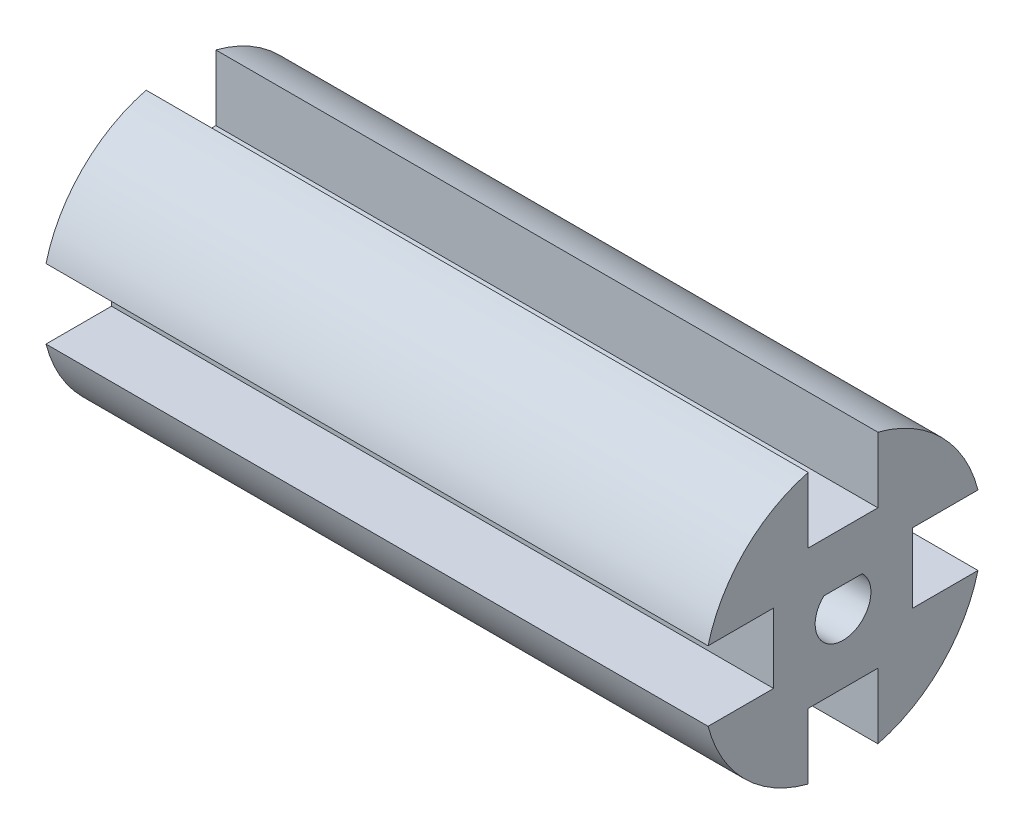
ISO-10303-21;
HEADER;
FILE_DESCRIPTION(('STEP AP214'),'2;1');
FILE_NAME('part.step','',(''),(''),'','','');
FILE_SCHEMA(('AUTOMOTIVE_DESIGN { 1 0 10303 214 1 1 1 1 }'));
ENDSEC;
DATA;
#1=APPLICATION_CONTEXT('core data for automotive mechanical design processes');
#2=APPLICATION_PROTOCOL_DEFINITION('international standard','automotive_design',2000,#1);
#3=PRODUCT_CONTEXT('',#1,'mechanical');
#4=PRODUCT('Part','Part','',(#3));
#5=PRODUCT_RELATED_PRODUCT_CATEGORY('part','',(#4));
#6=PRODUCT_DEFINITION_FORMATION('','',#4);
#7=PRODUCT_DEFINITION_CONTEXT('part definition',#1,'design');
#8=PRODUCT_DEFINITION('design','',#6,#7);
#9=PRODUCT_DEFINITION_SHAPE('','',#8);
#10=(LENGTH_UNIT() NAMED_UNIT(*) SI_UNIT(.MILLI.,.METRE.));
#11=(NAMED_UNIT(*) PLANE_ANGLE_UNIT() SI_UNIT($,.RADIAN.));
#12=(NAMED_UNIT(*) SI_UNIT($,.STERADIAN.) SOLID_ANGLE_UNIT());
#13=UNCERTAINTY_MEASURE_WITH_UNIT(LENGTH_MEASURE(1.E-05),#10,'distance_accuracy_value','');
#14=(GEOMETRIC_REPRESENTATION_CONTEXT(3) GLOBAL_UNCERTAINTY_ASSIGNED_CONTEXT((#13)) GLOBAL_UNIT_ASSIGNED_CONTEXT((#10,
#11,#12)) REPRESENTATION_CONTEXT('',''));
#15=CARTESIAN_POINT('',(0.,0.,0.));
#16=DIRECTION('',(0.,0.,1.));
#17=DIRECTION('',(1.,0.,0.));
#18=AXIS2_PLACEMENT_3D('',#15,#16,#17);
#19=CARTESIAN_POINT('',(95.,0.,0.));
#20=DIRECTION('',(1.,0.,0.));
#21=DIRECTION('',(0.,0.,-1.));
#22=AXIS2_PLACEMENT_3D('',#19,#20,#21);
#23=PLANE('',#22);
#24=DIRECTION('',(0.,0.,-1.));
#25=VECTOR('',#24,1.);
#26=CARTESIAN_POINT('',(95.,5.,0.));
#27=LINE('',#26,#25);
#28=CARTESIAN_POINT('',(95.,5.,-9.96491673103709));
#29=VERTEX_POINT('',#28);
#30=CARTESIAN_POINT('',(95.,5.,-19.3649167310371));
#31=VERTEX_POINT('',#30);
#32=EDGE_CURVE('E235',#29,#31,#27,.T.);
#33=ORIENTED_EDGE('',*,*,#32,.T.);
#34=CARTESIAN_POINT('',(95.,0.,0.));
#35=DIRECTION('',(1.,0.,0.));
#36=DIRECTION('',(0.,0.,-1.));
#37=AXIS2_PLACEMENT_3D('',#34,#35,#36);
#38=CIRCLE('',#37,20.);
#39=CARTESIAN_POINT('',(95.,19.3649167310371,-5.));
#40=VERTEX_POINT('',#39);
#41=EDGE_CURVE('E125',#31,#40,#38,.T.);
#42=ORIENTED_EDGE('',*,*,#41,.T.);
#43=DIRECTION('',(0.,1.,0.));
#44=VECTOR('',#43,1.);
#45=CARTESIAN_POINT('',(95.,0.,-5.));
#46=LINE('',#45,#44);
#47=CARTESIAN_POINT('',(95.,9.96491673103709,-5.));
#48=VERTEX_POINT('',#47);
#49=EDGE_CURVE('E268',#48,#40,#46,.T.);
#50=ORIENTED_EDGE('',*,*,#49,.F.);
#51=DIRECTION('',(0.,0.,-1.));
#52=VECTOR('',#51,1.);
#53=CARTESIAN_POINT('',(95.,9.96491673103709,0.));
#54=LINE('',#53,#52);
#55=CARTESIAN_POINT('',(95.,9.96491673103709,5.));
#56=VERTEX_POINT('',#55);
#57=EDGE_CURVE('E281',#56,#48,#54,.T.);
#58=ORIENTED_EDGE('',*,*,#57,.F.);
#59=DIRECTION('',(0.,1.,0.));
#60=VECTOR('',#59,1.);
#61=CARTESIAN_POINT('',(95.,0.,5.));
#62=LINE('',#61,#60);
#63=CARTESIAN_POINT('',(95.,19.3649167310371,5.));
#64=VERTEX_POINT('',#63);
#65=EDGE_CURVE('E283',#56,#64,#62,.T.);
#66=ORIENTED_EDGE('',*,*,#65,.T.);
#67=CARTESIAN_POINT('',(95.,5.,19.3649167310371));
#68=VERTEX_POINT('',#67);
#69=EDGE_CURVE('E285',#64,#68,#38,.T.);
#70=ORIENTED_EDGE('',*,*,#69,.T.);
#71=DIRECTION('',(0.,0.,-1.));
#72=VECTOR('',#71,1.);
#73=CARTESIAN_POINT('',(95.,5.,0.));
#74=LINE('',#73,#72);
#75=CARTESIAN_POINT('',(95.,5.,9.96491673103709));
#76=VERTEX_POINT('',#75);
#77=EDGE_CURVE('E289',#68,#76,#74,.T.);
#78=ORIENTED_EDGE('',*,*,#77,.T.);
#79=DIRECTION('',(0.,-1.,0.));
#80=VECTOR('',#79,1.);
#81=CARTESIAN_POINT('',(95.,0.,9.96491673103709));
#82=LINE('',#81,#80);
#83=CARTESIAN_POINT('',(95.,-5.,9.96491673103709));
#84=VERTEX_POINT('',#83);
#85=EDGE_CURVE('E291',#76,#84,#82,.T.);
#86=ORIENTED_EDGE('',*,*,#85,.T.);
#87=DIRECTION('',(0.,0.,-1.));
#88=VECTOR('',#87,1.);
#89=CARTESIAN_POINT('',(95.,-5.,0.));
#90=LINE('',#89,#88);
#91=CARTESIAN_POINT('',(95.,-5.,19.3649167310371));
#92=VERTEX_POINT('',#91);
#93=EDGE_CURVE('E293',#92,#84,#90,.T.);
#94=ORIENTED_EDGE('',*,*,#93,.F.);
#95=CARTESIAN_POINT('',(95.,-19.3649167310371,5.));
#96=VERTEX_POINT('',#95);
#97=EDGE_CURVE('E179',#92,#96,#38,.T.);
#98=ORIENTED_EDGE('',*,*,#97,.T.);
#99=DIRECTION('',(0.,1.,0.));
#100=VECTOR('',#99,1.);
#101=CARTESIAN_POINT('',(95.,0.,5.));
#102=LINE('',#101,#100);
#103=CARTESIAN_POINT('',(95.,-9.96491673103708,5.));
#104=VERTEX_POINT('',#103);
#105=EDGE_CURVE('E296',#96,#104,#102,.T.);
#106=ORIENTED_EDGE('',*,*,#105,.T.);
#107=DIRECTION('',(0.,0.,-1.));
#108=VECTOR('',#107,1.);
#109=CARTESIAN_POINT('',(95.,-9.96491673103708,0.));
#110=LINE('',#109,#108);
#111=CARTESIAN_POINT('',(95.,-9.96491673103708,-5.));
#112=VERTEX_POINT('',#111);
#113=EDGE_CURVE('E297',#104,#112,#110,.T.);
#114=ORIENTED_EDGE('',*,*,#113,.T.);
#115=DIRECTION('',(0.,1.,0.));
#116=VECTOR('',#115,1.);
#117=CARTESIAN_POINT('',(95.,0.,-5.));
#118=LINE('',#117,#116);
#119=CARTESIAN_POINT('',(95.,-19.3649167310371,-5.));
#120=VERTEX_POINT('',#119);
#121=EDGE_CURVE('E176',#120,#112,#118,.T.);
#122=ORIENTED_EDGE('',*,*,#121,.F.);
#123=CARTESIAN_POINT('',(95.,-5.,-19.3649167310371));
#124=VERTEX_POINT('',#123);
#125=EDGE_CURVE('E169',#120,#124,#38,.T.);
#126=ORIENTED_EDGE('',*,*,#125,.T.);
#127=DIRECTION('',(0.,0.,-1.));
#128=VECTOR('',#127,1.);
#129=CARTESIAN_POINT('',(95.,-5.,0.));
#130=LINE('',#129,#128);
#131=CARTESIAN_POINT('',(95.,-5.,-9.96491673103709));
#132=VERTEX_POINT('',#131);
#133=EDGE_CURVE('E174',#132,#124,#130,.T.);
#134=ORIENTED_EDGE('',*,*,#133,.F.);
#135=DIRECTION('',(0.,-1.,0.));
#136=VECTOR('',#135,1.);
#137=CARTESIAN_POINT('',(95.,0.,-9.96491673103709));
#138=LINE('',#137,#136);
#139=EDGE_CURVE('E192',#29,#132,#138,.T.);
#140=ORIENTED_EDGE('',*,*,#139,.F.);
#141=EDGE_LOOP('',(#33,#42,#50,#58,#66,#70,#78,#86,#94,#98,#106,#114,#122,#126,#134,#140));
#142=FACE_BOUND('',#141,.T.);
#143=CARTESIAN_POINT('',(95.,0.,0.));
#144=DIRECTION('',(1.,0.,0.));
#145=DIRECTION('',(0.,0.,-1.));
#146=AXIS2_PLACEMENT_3D('',#143,#144,#145);
#147=CIRCLE('',#146,4.);
#148=CARTESIAN_POINT('',(95.,2.9,2.75499546279118));
#149=VERTEX_POINT('',#148);
#150=CARTESIAN_POINT('',(95.,2.9,-2.75499546279118));
#151=VERTEX_POINT('',#150);
#152=EDGE_CURVE('E515',#149,#151,#147,.T.);
#153=ORIENTED_EDGE('',*,*,#152,.F.);
#154=DIRECTION('',(0.,0.,-1.));
#155=VECTOR('',#154,1.);
#156=CARTESIAN_POINT('',(95.,2.9,0.));
#157=LINE('',#156,#155);
#158=EDGE_CURVE('E53',#149,#151,#157,.T.);
#159=ORIENTED_EDGE('',*,*,#158,.T.);
#160=EDGE_LOOP('',(#153,#159));
#161=FACE_BOUND('',#160,.T.);
#162=ADVANCED_FACE('F38',(#142,#161),#23,.T.);
#163=CARTESIAN_POINT('',(95.,5.,0.));
#164=DIRECTION('',(0.,1.,0.));
#165=DIRECTION('',(0.,0.,1.));
#166=AXIS2_PLACEMENT_3D('',#163,#164,#165);
#167=PLANE('',#166);
#168=DIRECTION('',(0.,0.,-1.));
#169=VECTOR('',#168,1.);
#170=CARTESIAN_POINT('',(0.,5.,0.));
#171=LINE('',#170,#169);
#172=CARTESIAN_POINT('',(0.,5.,-9.96491673103709));
#173=VERTEX_POINT('',#172);
#174=CARTESIAN_POINT('',(0.,5.,-19.3649167310371));
#175=VERTEX_POINT('',#174);
#176=EDGE_CURVE('E198',#173,#175,#171,.T.);
#177=ORIENTED_EDGE('',*,*,#176,.T.);
#178=DIRECTION('',(-1.,0.,0.));
#179=VECTOR('',#178,1.);
#180=CARTESIAN_POINT('',(95.,5.,-19.3649167310371));
#181=LINE('',#180,#179);
#182=EDGE_CURVE('E11',#31,#175,#181,.T.);
#183=ORIENTED_EDGE('',*,*,#182,.F.);
#184=ORIENTED_EDGE('',*,*,#32,.F.);
#185=DIRECTION('',(-1.,0.,0.));
#186=VECTOR('',#185,1.);
#187=CARTESIAN_POINT('',(95.,5.,-9.96491673103709));
#188=LINE('',#187,#186);
#189=EDGE_CURVE('E62',#29,#173,#188,.T.);
#190=ORIENTED_EDGE('',*,*,#189,.T.);
#191=EDGE_LOOP('',(#177,#183,#184,#190));
#192=FACE_BOUND('',#191,.T.);
#193=ADVANCED_FACE('F40',(#192),#167,.F.);
#194=CARTESIAN_POINT('',(95.,0.,0.));
#195=DIRECTION('',(-1.,0.,0.));
#196=DIRECTION('',(0.,0.,1.));
#197=AXIS2_PLACEMENT_3D('',#194,#195,#196);
#198=CYLINDRICAL_SURFACE('',#197,20.);
#199=CARTESIAN_POINT('',(0.,0.,0.));
#200=DIRECTION('',(1.,0.,0.));
#201=DIRECTION('',(0.,0.,-1.));
#202=AXIS2_PLACEMENT_3D('',#199,#200,#201);
#203=CIRCLE('',#202,20.);
#204=CARTESIAN_POINT('',(0.,19.3649167310371,-5.));
#205=VERTEX_POINT('',#204);
#206=EDGE_CURVE('E200',#175,#205,#203,.T.);
#207=ORIENTED_EDGE('',*,*,#206,.T.);
#208=DIRECTION('',(-1.,0.,0.));
#209=VECTOR('',#208,1.);
#210=CARTESIAN_POINT('',(95.,19.3649167310371,-5.));
#211=LINE('',#210,#209);
#212=EDGE_CURVE('E46',#40,#205,#211,.T.);
#213=ORIENTED_EDGE('',*,*,#212,.F.);
#214=ORIENTED_EDGE('',*,*,#41,.F.);
#215=ORIENTED_EDGE('',*,*,#182,.T.);
#216=EDGE_LOOP('',(#207,#213,#214,#215));
#217=FACE_BOUND('',#216,.T.);
#218=ADVANCED_FACE('F269',(#217),#198,.T.);
#219=CARTESIAN_POINT('',(95.,0.,-5.));
#220=DIRECTION('',(0.,0.,1.));
#221=DIRECTION('',(0.,-1.,0.));
#222=AXIS2_PLACEMENT_3D('',#219,#220,#221);
#223=PLANE('',#222);
#224=DIRECTION('',(0.,1.,0.));
#225=VECTOR('',#224,1.);
#226=CARTESIAN_POINT('',(0.,0.,-5.));
#227=LINE('',#226,#225);
#228=CARTESIAN_POINT('',(0.,9.96491673103709,-5.));
#229=VERTEX_POINT('',#228);
#230=EDGE_CURVE('E204',#229,#205,#227,.T.);
#231=ORIENTED_EDGE('',*,*,#230,.F.);
#232=DIRECTION('',(-1.,0.,0.));
#233=VECTOR('',#232,1.);
#234=CARTESIAN_POINT('',(95.,9.96491673103709,-5.));
#235=LINE('',#234,#233);
#236=EDGE_CURVE('E262',#48,#229,#235,.T.);
#237=ORIENTED_EDGE('',*,*,#236,.F.);
#238=ORIENTED_EDGE('',*,*,#49,.T.);
#239=ORIENTED_EDGE('',*,*,#212,.T.);
#240=EDGE_LOOP('',(#231,#237,#238,#239));
#241=FACE_BOUND('',#240,.T.);
#242=ADVANCED_FACE('F266',(#241),#223,.T.);
#243=CARTESIAN_POINT('',(95.,9.96491673103709,0.));
#244=DIRECTION('',(0.,1.,0.));
#245=DIRECTION('',(0.,0.,1.));
#246=AXIS2_PLACEMENT_3D('',#243,#244,#245);
#247=PLANE('',#246);
#248=DIRECTION('',(0.,0.,-1.));
#249=VECTOR('',#248,1.);
#250=CARTESIAN_POINT('',(0.,9.96491673103709,0.));
#251=LINE('',#250,#249);
#252=CARTESIAN_POINT('',(0.,9.96491673103709,5.));
#253=VERTEX_POINT('',#252);
#254=EDGE_CURVE('E208',#253,#229,#251,.T.);
#255=ORIENTED_EDGE('',*,*,#254,.F.);
#256=DIRECTION('',(-1.,0.,0.));
#257=VECTOR('',#256,1.);
#258=CARTESIAN_POINT('',(95.,9.96491673103709,5.));
#259=LINE('',#258,#257);
#260=EDGE_CURVE('E260',#56,#253,#259,.T.);
#261=ORIENTED_EDGE('',*,*,#260,.F.);
#262=ORIENTED_EDGE('',*,*,#57,.T.);
#263=ORIENTED_EDGE('',*,*,#236,.T.);
#264=EDGE_LOOP('',(#255,#261,#262,#263));
#265=FACE_BOUND('',#264,.T.);
#266=ADVANCED_FACE('F277',(#265),#247,.T.);
#267=CARTESIAN_POINT('',(95.,0.,5.));
#268=DIRECTION('',(0.,0.,1.));
#269=DIRECTION('',(0.,-1.,0.));
#270=AXIS2_PLACEMENT_3D('',#267,#268,#269);
#271=PLANE('',#270);
#272=DIRECTION('',(0.,1.,0.));
#273=VECTOR('',#272,1.);
#274=CARTESIAN_POINT('',(0.,0.,5.));
#275=LINE('',#274,#273);
#276=CARTESIAN_POINT('',(0.,19.3649167310371,5.));
#277=VERTEX_POINT('',#276);
#278=EDGE_CURVE('E211',#253,#277,#275,.T.);
#279=ORIENTED_EDGE('',*,*,#278,.T.);
#280=DIRECTION('',(-1.,0.,0.));
#281=VECTOR('',#280,1.);
#282=CARTESIAN_POINT('',(95.,19.3649167310371,5.));
#283=LINE('',#282,#281);
#284=EDGE_CURVE('E257',#64,#277,#283,.T.);
#285=ORIENTED_EDGE('',*,*,#284,.F.);
#286=ORIENTED_EDGE('',*,*,#65,.F.);
#287=ORIENTED_EDGE('',*,*,#260,.T.);
#288=EDGE_LOOP('',(#279,#285,#286,#287));
#289=FACE_BOUND('',#288,.T.);
#290=ADVANCED_FACE('F465',(#289),#271,.F.);
#291=CARTESIAN_POINT('',(0.,5.,19.3649167310371));
#292=VERTEX_POINT('',#291);
#293=EDGE_CURVE('E205',#277,#292,#203,.T.);
#294=ORIENTED_EDGE('',*,*,#293,.T.);
#295=DIRECTION('',(-1.,0.,0.));
#296=VECTOR('',#295,1.);
#297=CARTESIAN_POINT('',(95.,5.,19.3649167310371));
#298=LINE('',#297,#296);
#299=EDGE_CURVE('E254',#68,#292,#298,.T.);
#300=ORIENTED_EDGE('',*,*,#299,.F.);
#301=ORIENTED_EDGE('',*,*,#69,.F.);
#302=ORIENTED_EDGE('',*,*,#284,.T.);
#303=EDGE_LOOP('',(#294,#300,#301,#302));
#304=FACE_BOUND('',#303,.T.);
#305=ADVANCED_FACE('F309',(#304),#198,.T.);
#306=CARTESIAN_POINT('',(95.,5.,0.));
#307=DIRECTION('',(0.,1.,0.));
#308=DIRECTION('',(0.,0.,1.));
#309=AXIS2_PLACEMENT_3D('',#306,#307,#308);
#310=PLANE('',#309);
#311=DIRECTION('',(0.,0.,-1.));
#312=VECTOR('',#311,1.);
#313=CARTESIAN_POINT('',(0.,5.,0.));
#314=LINE('',#313,#312);
#315=CARTESIAN_POINT('',(0.,5.,9.96491673103709));
#316=VERTEX_POINT('',#315);
#317=EDGE_CURVE('E213',#292,#316,#314,.T.);
#318=ORIENTED_EDGE('',*,*,#317,.T.);
#319=DIRECTION('',(-1.,0.,0.));
#320=VECTOR('',#319,1.);
#321=CARTESIAN_POINT('',(95.,5.,9.96491673103709));
#322=LINE('',#321,#320);
#323=EDGE_CURVE('E251',#76,#316,#322,.T.);
#324=ORIENTED_EDGE('',*,*,#323,.F.);
#325=ORIENTED_EDGE('',*,*,#77,.F.);
#326=ORIENTED_EDGE('',*,*,#299,.T.);
#327=EDGE_LOOP('',(#318,#324,#325,#326));
#328=FACE_BOUND('',#327,.T.);
#329=ADVANCED_FACE('F315',(#328),#310,.F.);
#330=CARTESIAN_POINT('',(95.,0.,9.96491673103709));
#331=DIRECTION('',(0.,0.,-1.));
#332=DIRECTION('',(-1.,0.,0.));
#333=AXIS2_PLACEMENT_3D('',#330,#331,#332);
#334=PLANE('',#333);
#335=DIRECTION('',(0.,-1.,0.));
#336=VECTOR('',#335,1.);
#337=CARTESIAN_POINT('',(0.,0.,9.96491673103709));
#338=LINE('',#337,#336);
#339=CARTESIAN_POINT('',(0.,-5.,9.96491673103709));
#340=VERTEX_POINT('',#339);
#341=EDGE_CURVE('E215',#316,#340,#338,.T.);
#342=ORIENTED_EDGE('',*,*,#341,.T.);
#343=DIRECTION('',(-1.,0.,0.));
#344=VECTOR('',#343,1.);
#345=CARTESIAN_POINT('',(95.,-5.,9.96491673103709));
#346=LINE('',#345,#344);
#347=EDGE_CURVE('E249',#84,#340,#346,.T.);
#348=ORIENTED_EDGE('',*,*,#347,.F.);
#349=ORIENTED_EDGE('',*,*,#85,.F.);
#350=ORIENTED_EDGE('',*,*,#323,.T.);
#351=EDGE_LOOP('',(#342,#348,#349,#350));
#352=FACE_BOUND('',#351,.T.);
#353=ADVANCED_FACE('F321',(#352),#334,.F.);
#354=CARTESIAN_POINT('',(95.,-5.,0.));
#355=DIRECTION('',(0.,1.,0.));
#356=DIRECTION('',(0.,0.,1.));
#357=AXIS2_PLACEMENT_3D('',#354,#355,#356);
#358=PLANE('',#357);
#359=DIRECTION('',(0.,0.,-1.));
#360=VECTOR('',#359,1.);
#361=CARTESIAN_POINT('',(0.,-5.,0.));
#362=LINE('',#361,#360);
#363=CARTESIAN_POINT('',(0.,-5.,19.3649167310371));
#364=VERTEX_POINT('',#363);
#365=EDGE_CURVE('E218',#364,#340,#362,.T.);
#366=ORIENTED_EDGE('',*,*,#365,.F.);
#367=DIRECTION('',(-1.,0.,0.));
#368=VECTOR('',#367,1.);
#369=CARTESIAN_POINT('',(95.,-5.,19.3649167310371));
#370=LINE('',#369,#368);
#371=EDGE_CURVE('E247',#92,#364,#370,.T.);
#372=ORIENTED_EDGE('',*,*,#371,.F.);
#373=ORIENTED_EDGE('',*,*,#93,.T.);
#374=ORIENTED_EDGE('',*,*,#347,.T.);
#375=EDGE_LOOP('',(#366,#372,#373,#374));
#376=FACE_BOUND('',#375,.T.);
#377=ADVANCED_FACE('F334',(#376),#358,.T.);
#378=CARTESIAN_POINT('',(0.,-19.3649167310371,5.));
#379=VERTEX_POINT('',#378);
#380=EDGE_CURVE('E221',#364,#379,#203,.T.);
#381=ORIENTED_EDGE('',*,*,#380,.T.);
#382=DIRECTION('',(-1.,0.,0.));
#383=VECTOR('',#382,1.);
#384=CARTESIAN_POINT('',(95.,-19.3649167310371,5.));
#385=LINE('',#384,#383);
#386=EDGE_CURVE('E244',#96,#379,#385,.T.);
#387=ORIENTED_EDGE('',*,*,#386,.F.);
#388=ORIENTED_EDGE('',*,*,#97,.F.);
#389=ORIENTED_EDGE('',*,*,#371,.T.);
#390=EDGE_LOOP('',(#381,#387,#388,#389));
#391=FACE_BOUND('',#390,.T.);
#392=ADVANCED_FACE('F327',(#391),#198,.T.);
#393=CARTESIAN_POINT('',(95.,0.,5.));
#394=DIRECTION('',(0.,0.,1.));
#395=DIRECTION('',(0.,-1.,0.));
#396=AXIS2_PLACEMENT_3D('',#393,#394,#395);
#397=PLANE('',#396);
#398=DIRECTION('',(0.,1.,0.));
#399=VECTOR('',#398,1.);
#400=CARTESIAN_POINT('',(0.,0.,5.));
#401=LINE('',#400,#399);
#402=CARTESIAN_POINT('',(0.,-9.96491673103708,5.));
#403=VERTEX_POINT('',#402);
#404=EDGE_CURVE('E222',#379,#403,#401,.T.);
#405=ORIENTED_EDGE('',*,*,#404,.T.);
#406=DIRECTION('',(-1.,0.,0.));
#407=VECTOR('',#406,1.);
#408=CARTESIAN_POINT('',(95.,-9.96491673103708,5.));
#409=LINE('',#408,#407);
#410=EDGE_CURVE('E241',#104,#403,#409,.T.);
#411=ORIENTED_EDGE('',*,*,#410,.F.);
#412=ORIENTED_EDGE('',*,*,#105,.F.);
#413=ORIENTED_EDGE('',*,*,#386,.T.);
#414=EDGE_LOOP('',(#405,#411,#412,#413));
#415=FACE_BOUND('',#414,.T.);
#416=ADVANCED_FACE('F330',(#415),#397,.F.);
#417=CARTESIAN_POINT('',(95.,-9.96491673103708,0.));
#418=DIRECTION('',(0.,1.,0.));
#419=DIRECTION('',(0.,0.,1.));
#420=AXIS2_PLACEMENT_3D('',#417,#418,#419);
#421=PLANE('',#420);
#422=DIRECTION('',(0.,0.,-1.));
#423=VECTOR('',#422,1.);
#424=CARTESIAN_POINT('',(0.,-9.96491673103708,0.));
#425=LINE('',#424,#423);
#426=CARTESIAN_POINT('',(0.,-9.96491673103708,-5.));
#427=VERTEX_POINT('',#426);
#428=EDGE_CURVE('E224',#403,#427,#425,.T.);
#429=ORIENTED_EDGE('',*,*,#428,.T.);
#430=DIRECTION('',(-1.,0.,0.));
#431=VECTOR('',#430,1.);
#432=CARTESIAN_POINT('',(95.,-9.96491673103708,-5.));
#433=LINE('',#432,#431);
#434=EDGE_CURVE('E239',#112,#427,#433,.T.);
#435=ORIENTED_EDGE('',*,*,#434,.F.);
#436=ORIENTED_EDGE('',*,*,#113,.F.);
#437=ORIENTED_EDGE('',*,*,#410,.T.);
#438=EDGE_LOOP('',(#429,#435,#436,#437));
#439=FACE_BOUND('',#438,.T.);
#440=ADVANCED_FACE('F332',(#439),#421,.F.);
#441=CARTESIAN_POINT('',(95.,0.,-5.));
#442=DIRECTION('',(0.,0.,1.));
#443=DIRECTION('',(0.,-1.,0.));
#444=AXIS2_PLACEMENT_3D('',#441,#442,#443);
#445=PLANE('',#444);
#446=DIRECTION('',(0.,1.,0.));
#447=VECTOR('',#446,1.);
#448=CARTESIAN_POINT('',(0.,0.,-5.));
#449=LINE('',#448,#447);
#450=CARTESIAN_POINT('',(0.,-19.3649167310371,-5.));
#451=VERTEX_POINT('',#450);
#452=EDGE_CURVE('E227',#451,#427,#449,.T.);
#453=ORIENTED_EDGE('',*,*,#452,.F.);
#454=DIRECTION('',(-1.,0.,0.));
#455=VECTOR('',#454,1.);
#456=CARTESIAN_POINT('',(95.,-19.3649167310371,-5.));
#457=LINE('',#456,#455);
#458=EDGE_CURVE('E188',#120,#451,#457,.T.);
#459=ORIENTED_EDGE('',*,*,#458,.F.);
#460=ORIENTED_EDGE('',*,*,#121,.T.);
#461=ORIENTED_EDGE('',*,*,#434,.T.);
#462=EDGE_LOOP('',(#453,#459,#460,#461));
#463=FACE_BOUND('',#462,.T.);
#464=ADVANCED_FACE('F302',(#463),#445,.T.);
#465=CARTESIAN_POINT('',(0.,-5.,-19.3649167310371));
#466=VERTEX_POINT('',#465);
#467=EDGE_CURVE('E184',#451,#466,#203,.T.);
#468=ORIENTED_EDGE('',*,*,#467,.T.);
#469=DIRECTION('',(-1.,0.,0.));
#470=VECTOR('',#469,1.);
#471=CARTESIAN_POINT('',(95.,-5.,-19.3649167310371));
#472=LINE('',#471,#470);
#473=EDGE_CURVE('E181',#124,#466,#472,.T.);
#474=ORIENTED_EDGE('',*,*,#473,.F.);
#475=ORIENTED_EDGE('',*,*,#125,.F.);
#476=ORIENTED_EDGE('',*,*,#458,.T.);
#477=EDGE_LOOP('',(#468,#474,#475,#476));
#478=FACE_BOUND('',#477,.T.);
#479=ADVANCED_FACE('F182',(#478),#198,.T.);
#480=CARTESIAN_POINT('',(95.,-5.,0.));
#481=DIRECTION('',(0.,1.,0.));
#482=DIRECTION('',(0.,0.,1.));
#483=AXIS2_PLACEMENT_3D('',#480,#481,#482);
#484=PLANE('',#483);
#485=DIRECTION('',(0.,0.,-1.));
#486=VECTOR('',#485,1.);
#487=CARTESIAN_POINT('',(0.,-5.,0.));
#488=LINE('',#487,#486);
#489=CARTESIAN_POINT('',(0.,-5.,-9.96491673103709));
#490=VERTEX_POINT('',#489);
#491=EDGE_CURVE('E230',#490,#466,#488,.T.);
#492=ORIENTED_EDGE('',*,*,#491,.F.);
#493=DIRECTION('',(-1.,0.,0.));
#494=VECTOR('',#493,1.);
#495=CARTESIAN_POINT('',(95.,-5.,-9.96491673103709));
#496=LINE('',#495,#494);
#497=EDGE_CURVE('E189',#132,#490,#496,.T.);
#498=ORIENTED_EDGE('',*,*,#497,.F.);
#499=ORIENTED_EDGE('',*,*,#133,.T.);
#500=ORIENTED_EDGE('',*,*,#473,.T.);
#501=EDGE_LOOP('',(#492,#498,#499,#500));
#502=FACE_BOUND('',#501,.T.);
#503=ADVANCED_FACE('F191',(#502),#484,.T.);
#504=CARTESIAN_POINT('',(95.,0.,-9.96491673103709));
#505=DIRECTION('',(0.,0.,-1.));
#506=DIRECTION('',(0.,1.,0.));
#507=AXIS2_PLACEMENT_3D('',#504,#505,#506);
#508=PLANE('',#507);
#509=DIRECTION('',(0.,-1.,0.));
#510=VECTOR('',#509,1.);
#511=CARTESIAN_POINT('',(0.,0.,-9.96491673103709));
#512=LINE('',#511,#510);
#513=EDGE_CURVE('E232',#173,#490,#512,.T.);
#514=ORIENTED_EDGE('',*,*,#513,.F.);
#515=ORIENTED_EDGE('',*,*,#189,.F.);
#516=ORIENTED_EDGE('',*,*,#139,.T.);
#517=ORIENTED_EDGE('',*,*,#497,.T.);
#518=EDGE_LOOP('',(#514,#515,#516,#517));
#519=FACE_BOUND('',#518,.T.);
#520=ADVANCED_FACE('F355',(#519),#508,.T.);
#521=CARTESIAN_POINT('',(0.,0.,0.));
#522=DIRECTION('',(1.,0.,0.));
#523=DIRECTION('',(0.,0.,-1.));
#524=AXIS2_PLACEMENT_3D('',#521,#522,#523);
#525=PLANE('',#524);
#526=ORIENTED_EDGE('',*,*,#176,.F.);
#527=ORIENTED_EDGE('',*,*,#513,.T.);
#528=ORIENTED_EDGE('',*,*,#491,.T.);
#529=ORIENTED_EDGE('',*,*,#467,.F.);
#530=ORIENTED_EDGE('',*,*,#452,.T.);
#531=ORIENTED_EDGE('',*,*,#428,.F.);
#532=ORIENTED_EDGE('',*,*,#404,.F.);
#533=ORIENTED_EDGE('',*,*,#380,.F.);
#534=ORIENTED_EDGE('',*,*,#365,.T.);
#535=ORIENTED_EDGE('',*,*,#341,.F.);
#536=ORIENTED_EDGE('',*,*,#317,.F.);
#537=ORIENTED_EDGE('',*,*,#293,.F.);
#538=ORIENTED_EDGE('',*,*,#278,.F.);
#539=ORIENTED_EDGE('',*,*,#254,.T.);
#540=ORIENTED_EDGE('',*,*,#230,.T.);
#541=ORIENTED_EDGE('',*,*,#206,.F.);
#542=EDGE_LOOP('',(#526,#527,#528,#529,#530,#531,#532,#533,#534,#535,#536,#537,#538,#539,#540,#541));
#543=FACE_BOUND('',#542,.T.);
#544=ADVANCED_FACE('F272',(#543),#525,.F.);
#545=CARTESIAN_POINT('',(75.,2.9,0.));
#546=DIRECTION('',(0.,-1.,0.));
#547=DIRECTION('',(0.,0.,-1.));
#548=AXIS2_PLACEMENT_3D('',#545,#546,#547);
#549=PLANE('',#548);
#550=ORIENTED_EDGE('',*,*,#158,.F.);
#551=DIRECTION('',(1.,0.,0.));
#552=VECTOR('',#551,1.);
#553=CARTESIAN_POINT('',(75.,2.9,2.75499546279118));
#554=LINE('',#553,#552);
#555=CARTESIAN_POINT('',(75.,2.9,2.75499546279118));
#556=VERTEX_POINT('',#555);
#557=EDGE_CURVE('E518',#556,#149,#554,.T.);
#558=ORIENTED_EDGE('',*,*,#557,.F.);
#559=DIRECTION('',(0.,0.,-1.));
#560=VECTOR('',#559,1.);
#561=CARTESIAN_POINT('',(75.,2.9,0.));
#562=LINE('',#561,#560);
#563=CARTESIAN_POINT('',(75.,2.9,-2.75499546279118));
#564=VERTEX_POINT('',#563);
#565=EDGE_CURVE('E510',#556,#564,#562,.T.);
#566=ORIENTED_EDGE('',*,*,#565,.T.);
#567=DIRECTION('',(1.,0.,0.));
#568=VECTOR('',#567,1.);
#569=CARTESIAN_POINT('',(75.,2.9,-2.75499546279118));
#570=LINE('',#569,#568);
#571=EDGE_CURVE('E201',#564,#151,#570,.T.);
#572=ORIENTED_EDGE('',*,*,#571,.T.);
#573=EDGE_LOOP('',(#550,#558,#566,#572));
#574=FACE_BOUND('',#573,.T.);
#575=ADVANCED_FACE('F351',(#574),#549,.T.);
#576=CARTESIAN_POINT('',(75.,0.,0.));
#577=DIRECTION('',(1.,0.,0.));
#578=DIRECTION('',(0.,0.,-1.));
#579=AXIS2_PLACEMENT_3D('',#576,#577,#578);
#580=CYLINDRICAL_SURFACE('',#579,4.);
#581=ORIENTED_EDGE('',*,*,#152,.T.);
#582=ORIENTED_EDGE('',*,*,#571,.F.);
#583=CARTESIAN_POINT('',(75.,0.,0.));
#584=DIRECTION('',(1.,0.,0.));
#585=DIRECTION('',(0.,0.,-1.));
#586=AXIS2_PLACEMENT_3D('',#583,#584,#585);
#587=CIRCLE('',#586,4.);
#588=EDGE_CURVE('E512',#556,#564,#587,.T.);
#589=ORIENTED_EDGE('',*,*,#588,.F.);
#590=ORIENTED_EDGE('',*,*,#557,.T.);
#591=EDGE_LOOP('',(#581,#582,#589,#590));
#592=FACE_BOUND('',#591,.T.);
#593=ADVANCED_FACE('F399',(#592),#580,.F.);
#594=CARTESIAN_POINT('',(75.,0.,0.));
#595=DIRECTION('',(1.,0.,0.));
#596=DIRECTION('',(0.,0.,-1.));
#597=AXIS2_PLACEMENT_3D('',#594,#595,#596);
#598=PLANE('',#597);
#599=ORIENTED_EDGE('',*,*,#565,.F.);
#600=ORIENTED_EDGE('',*,*,#588,.T.);
#601=EDGE_LOOP('',(#599,#600));
#602=FACE_BOUND('',#601,.T.);
#603=ADVANCED_FACE('F405',(#602),#598,.T.);
#604=CLOSED_SHELL('',(#162,#193,#218,#242,#266,#290,#305,#329,#353,#377,#392,#416,#440,#464,
#479,#503,#520,#544,#575,#593,#603));
#605=MANIFOLD_SOLID_BREP('B2',#604);
#606=ADVANCED_BREP_SHAPE_REPRESENTATION('',(#18,#605),#14);
#607=SHAPE_DEFINITION_REPRESENTATION(#9,#606);
ENDSEC;
END-ISO-10303-21;
